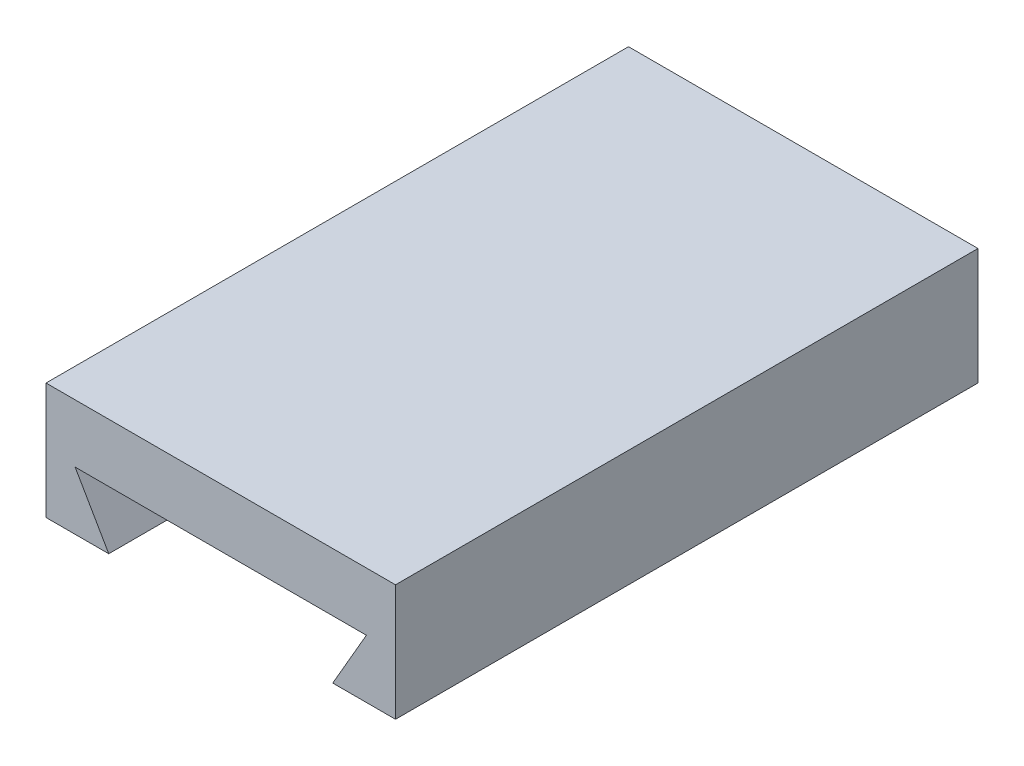
ISO-10303-21;
HEADER;
FILE_DESCRIPTION(('STEP AP214'),'2;1');
FILE_NAME('part.step','',(''),(''),'','','');
FILE_SCHEMA(('AUTOMOTIVE_DESIGN { 1 0 10303 214 1 1 1 1 }'));
ENDSEC;
DATA;
#1=APPLICATION_CONTEXT('core data for automotive mechanical design processes');
#2=APPLICATION_PROTOCOL_DEFINITION('international standard','automotive_design',2000,#1);
#3=PRODUCT_CONTEXT('',#1,'mechanical');
#4=PRODUCT('Part','Part','',(#3));
#5=PRODUCT_RELATED_PRODUCT_CATEGORY('part','',(#4));
#6=PRODUCT_DEFINITION_FORMATION('','',#4);
#7=PRODUCT_DEFINITION_CONTEXT('part definition',#1,'design');
#8=PRODUCT_DEFINITION('design','',#6,#7);
#9=PRODUCT_DEFINITION_SHAPE('','',#8);
#10=(LENGTH_UNIT() NAMED_UNIT(*) SI_UNIT(.MILLI.,.METRE.));
#11=(NAMED_UNIT(*) PLANE_ANGLE_UNIT() SI_UNIT($,.RADIAN.));
#12=(NAMED_UNIT(*) SI_UNIT($,.STERADIAN.) SOLID_ANGLE_UNIT());
#13=UNCERTAINTY_MEASURE_WITH_UNIT(LENGTH_MEASURE(1.E-05),#10,'distance_accuracy_value','');
#14=(GEOMETRIC_REPRESENTATION_CONTEXT(3) GLOBAL_UNCERTAINTY_ASSIGNED_CONTEXT((#13)) GLOBAL_UNIT_ASSIGNED_CONTEXT((#10,
#11,#12)) REPRESENTATION_CONTEXT('',''));
#15=CARTESIAN_POINT('',(0.,0.,0.));
#16=DIRECTION('',(0.,0.,1.));
#17=DIRECTION('',(1.,0.,0.));
#18=AXIS2_PLACEMENT_3D('',#15,#16,#17);
#19=CARTESIAN_POINT('',(0.,0.500000000000001,5.));
#20=DIRECTION('',(0.,1.,0.));
#21=DIRECTION('',(-1.,0.,0.));
#22=AXIS2_PLACEMENT_3D('',#19,#20,#21);
#23=PLANE('',#22);
#24=DIRECTION('',(1.,0.,0.));
#25=VECTOR('',#24,1.);
#26=CARTESIAN_POINT('',(0.,0.500000000000001,0.));
#27=LINE('',#26,#25);
#28=CARTESIAN_POINT('',(-1.25,0.500000000000001,0.));
#29=VERTEX_POINT('',#28);
#30=CARTESIAN_POINT('',(1.25,0.5,0.));
#31=VERTEX_POINT('',#30);
#32=EDGE_CURVE('E168',#29,#31,#27,.T.);
#33=ORIENTED_EDGE('',*,*,#32,.T.);
#34=DIRECTION('',(0.,0.,-1.));
#35=VECTOR('',#34,1.);
#36=CARTESIAN_POINT('',(1.25,0.5,5.));
#37=LINE('',#36,#35);
#38=CARTESIAN_POINT('',(1.25,0.5,5.));
#39=VERTEX_POINT('',#38);
#40=EDGE_CURVE('E11',#39,#31,#37,.T.);
#41=ORIENTED_EDGE('',*,*,#40,.F.);
#42=DIRECTION('',(1.,0.,0.));
#43=VECTOR('',#42,1.);
#44=CARTESIAN_POINT('',(0.,0.500000000000001,5.));
#45=LINE('',#44,#43);
#46=CARTESIAN_POINT('',(-1.25,0.500000000000001,5.));
#47=VERTEX_POINT('',#46);
#48=EDGE_CURVE('E89',#47,#39,#45,.T.);
#49=ORIENTED_EDGE('',*,*,#48,.F.);
#50=DIRECTION('',(0.,0.,-1.));
#51=VECTOR('',#50,1.);
#52=CARTESIAN_POINT('',(-1.25,0.500000000000001,5.));
#53=LINE('',#52,#51);
#54=EDGE_CURVE('E51',#47,#29,#53,.T.);
#55=ORIENTED_EDGE('',*,*,#54,.T.);
#56=EDGE_LOOP('',(#33,#41,#49,#55));
#57=FACE_BOUND('',#56,.T.);
#58=ADVANCED_FACE('F35',(#57),#23,.F.);
#59=CARTESIAN_POINT('',(0.72099364905389,-0.416265877365274,5.));
#60=DIRECTION('',(-0.866025403784439,0.5,0.));
#61=DIRECTION('',(-0.5,-0.866025403784439,0.));
#62=AXIS2_PLACEMENT_3D('',#59,#60,#61);
#63=PLANE('',#62);
#64=DIRECTION('',(0.5,0.866025403784439,0.));
#65=VECTOR('',#64,1.);
#66=CARTESIAN_POINT('',(0.72099364905389,-0.416265877365274,0.));
#67=LINE('',#66,#65);
#68=CARTESIAN_POINT('',(0.961324865405187,0.,0.));
#69=VERTEX_POINT('',#68);
#70=EDGE_CURVE('E163',#69,#31,#67,.T.);
#71=ORIENTED_EDGE('',*,*,#70,.F.);
#72=DIRECTION('',(0.,0.,-1.));
#73=VECTOR('',#72,1.);
#74=CARTESIAN_POINT('',(0.961324865405187,0.,5.));
#75=LINE('',#74,#73);
#76=CARTESIAN_POINT('',(0.961324865405187,0.,5.));
#77=VERTEX_POINT('',#76);
#78=EDGE_CURVE('E43',#77,#69,#75,.T.);
#79=ORIENTED_EDGE('',*,*,#78,.F.);
#80=DIRECTION('',(0.5,0.866025403784439,0.));
#81=VECTOR('',#80,1.);
#82=CARTESIAN_POINT('',(0.72099364905389,-0.416265877365274,5.));
#83=LINE('',#82,#81);
#84=EDGE_CURVE('E132',#77,#39,#83,.T.);
#85=ORIENTED_EDGE('',*,*,#84,.T.);
#86=ORIENTED_EDGE('',*,*,#40,.T.);
#87=EDGE_LOOP('',(#71,#79,#85,#86));
#88=FACE_BOUND('',#87,.T.);
#89=ADVANCED_FACE('F167',(#88),#63,.T.);
#90=CARTESIAN_POINT('',(0.,0.,5.));
#91=DIRECTION('',(0.,1.,0.));
#92=DIRECTION('',(0.,0.,1.));
#93=AXIS2_PLACEMENT_3D('',#90,#91,#92);
#94=PLANE('',#93);
#95=DIRECTION('',(1.,0.,0.));
#96=VECTOR('',#95,1.);
#97=CARTESIAN_POINT('',(0.,0.,0.));
#98=LINE('',#97,#96);
#99=CARTESIAN_POINT('',(1.5,0.,0.));
#100=VERTEX_POINT('',#99);
#101=EDGE_CURVE('E145',#69,#100,#98,.T.);
#102=ORIENTED_EDGE('',*,*,#101,.T.);
#103=DIRECTION('',(0.,0.,-1.));
#104=VECTOR('',#103,1.);
#105=CARTESIAN_POINT('',(1.5,0.,5.));
#106=LINE('',#105,#104);
#107=CARTESIAN_POINT('',(1.5,0.,5.));
#108=VERTEX_POINT('',#107);
#109=EDGE_CURVE('E154',#108,#100,#106,.T.);
#110=ORIENTED_EDGE('',*,*,#109,.F.);
#111=DIRECTION('',(1.,0.,0.));
#112=VECTOR('',#111,1.);
#113=CARTESIAN_POINT('',(0.,0.,5.));
#114=LINE('',#113,#112);
#115=EDGE_CURVE('E127',#77,#108,#114,.T.);
#116=ORIENTED_EDGE('',*,*,#115,.F.);
#117=ORIENTED_EDGE('',*,*,#78,.T.);
#118=EDGE_LOOP('',(#102,#110,#116,#117));
#119=FACE_BOUND('',#118,.T.);
#120=ADVANCED_FACE('F158',(#119),#94,.F.);
#121=CARTESIAN_POINT('',(1.5,0.,5.));
#122=DIRECTION('',(1.,0.,0.));
#123=DIRECTION('',(0.,1.,0.));
#124=AXIS2_PLACEMENT_3D('',#121,#122,#123);
#125=PLANE('',#124);
#126=DIRECTION('',(0.,-1.,0.));
#127=VECTOR('',#126,1.);
#128=CARTESIAN_POINT('',(1.5,0.,0.));
#129=LINE('',#128,#127);
#130=CARTESIAN_POINT('',(1.5,1.,0.));
#131=VERTEX_POINT('',#130);
#132=EDGE_CURVE('E166',#131,#100,#129,.T.);
#133=ORIENTED_EDGE('',*,*,#132,.F.);
#134=DIRECTION('',(0.,0.,-1.));
#135=VECTOR('',#134,1.);
#136=CARTESIAN_POINT('',(1.5,1.,5.));
#137=LINE('',#136,#135);
#138=CARTESIAN_POINT('',(1.5,1.,5.));
#139=VERTEX_POINT('',#138);
#140=EDGE_CURVE('E152',#139,#131,#137,.T.);
#141=ORIENTED_EDGE('',*,*,#140,.F.);
#142=DIRECTION('',(0.,-1.,0.));
#143=VECTOR('',#142,1.);
#144=CARTESIAN_POINT('',(1.5,0.,5.));
#145=LINE('',#144,#143);
#146=EDGE_CURVE('E131',#139,#108,#145,.T.);
#147=ORIENTED_EDGE('',*,*,#146,.T.);
#148=ORIENTED_EDGE('',*,*,#109,.T.);
#149=EDGE_LOOP('',(#133,#141,#147,#148));
#150=FACE_BOUND('',#149,.T.);
#151=ADVANCED_FACE('F177',(#150),#125,.T.);
#152=CARTESIAN_POINT('',(0.,1.,5.));
#153=DIRECTION('',(0.,1.,0.));
#154=DIRECTION('',(0.,0.,1.));
#155=AXIS2_PLACEMENT_3D('',#152,#153,#154);
#156=PLANE('',#155);
#157=DIRECTION('',(1.,0.,0.));
#158=VECTOR('',#157,1.);
#159=CARTESIAN_POINT('',(0.,1.,0.));
#160=LINE('',#159,#158);
#161=CARTESIAN_POINT('',(-1.5,1.,0.));
#162=VERTEX_POINT('',#161);
#163=EDGE_CURVE('E172',#162,#131,#160,.T.);
#164=ORIENTED_EDGE('',*,*,#163,.F.);
#165=DIRECTION('',(0.,0.,-1.));
#166=VECTOR('',#165,1.);
#167=CARTESIAN_POINT('',(-1.5,1.,5.));
#168=LINE('',#167,#166);
#169=CARTESIAN_POINT('',(-1.5,1.,5.));
#170=VERTEX_POINT('',#169);
#171=EDGE_CURVE('E122',#170,#162,#168,.T.);
#172=ORIENTED_EDGE('',*,*,#171,.F.);
#173=DIRECTION('',(1.,0.,0.));
#174=VECTOR('',#173,1.);
#175=CARTESIAN_POINT('',(0.,1.,5.));
#176=LINE('',#175,#174);
#177=EDGE_CURVE('E112',#170,#139,#176,.T.);
#178=ORIENTED_EDGE('',*,*,#177,.T.);
#179=ORIENTED_EDGE('',*,*,#140,.T.);
#180=EDGE_LOOP('',(#164,#172,#178,#179));
#181=FACE_BOUND('',#180,.T.);
#182=ADVANCED_FACE('F175',(#181),#156,.T.);
#183=CARTESIAN_POINT('',(-1.5,0.,5.));
#184=DIRECTION('',(1.,0.,0.));
#185=DIRECTION('',(0.,1.,0.));
#186=AXIS2_PLACEMENT_3D('',#183,#184,#185);
#187=PLANE('',#186);
#188=DIRECTION('',(0.,-1.,0.));
#189=VECTOR('',#188,1.);
#190=CARTESIAN_POINT('',(-1.5,0.,0.));
#191=LINE('',#190,#189);
#192=CARTESIAN_POINT('',(-1.5,0.,0.));
#193=VERTEX_POINT('',#192);
#194=EDGE_CURVE('E119',#162,#193,#191,.T.);
#195=ORIENTED_EDGE('',*,*,#194,.T.);
#196=DIRECTION('',(0.,0.,-1.));
#197=VECTOR('',#196,1.);
#198=CARTESIAN_POINT('',(-1.5,0.,5.));
#199=LINE('',#198,#197);
#200=CARTESIAN_POINT('',(-1.5,0.,5.));
#201=VERTEX_POINT('',#200);
#202=EDGE_CURVE('E116',#201,#193,#199,.T.);
#203=ORIENTED_EDGE('',*,*,#202,.F.);
#204=DIRECTION('',(0.,-1.,0.));
#205=VECTOR('',#204,1.);
#206=CARTESIAN_POINT('',(-1.5,0.,5.));
#207=LINE('',#206,#205);
#208=EDGE_CURVE('E105',#170,#201,#207,.T.);
#209=ORIENTED_EDGE('',*,*,#208,.F.);
#210=ORIENTED_EDGE('',*,*,#171,.T.);
#211=EDGE_LOOP('',(#195,#203,#209,#210));
#212=FACE_BOUND('',#211,.T.);
#213=ADVANCED_FACE('F117',(#212),#187,.F.);
#214=CARTESIAN_POINT('',(-0.961324865405186,0.,0.));
#215=VERTEX_POINT('',#214);
#216=EDGE_CURVE('E141',#193,#215,#98,.T.);
#217=ORIENTED_EDGE('',*,*,#216,.T.);
#218=DIRECTION('',(0.,0.,-1.));
#219=VECTOR('',#218,1.);
#220=CARTESIAN_POINT('',(-0.961324865405186,0.,5.));
#221=LINE('',#220,#219);
#222=CARTESIAN_POINT('',(-0.961324865405186,0.,5.));
#223=VERTEX_POINT('',#222);
#224=EDGE_CURVE('E77',#223,#215,#221,.T.);
#225=ORIENTED_EDGE('',*,*,#224,.F.);
#226=EDGE_CURVE('E109',#201,#223,#114,.T.);
#227=ORIENTED_EDGE('',*,*,#226,.F.);
#228=ORIENTED_EDGE('',*,*,#202,.T.);
#229=EDGE_LOOP('',(#217,#225,#227,#228));
#230=FACE_BOUND('',#229,.T.);
#231=ADVANCED_FACE('F124',(#230),#94,.F.);
#232=CARTESIAN_POINT('',(-0.72099364905389,-0.416265877365273,5.));
#233=DIRECTION('',(0.866025403784439,0.5,0.));
#234=DIRECTION('',(-0.5,0.866025403784439,0.));
#235=AXIS2_PLACEMENT_3D('',#232,#233,#234);
#236=PLANE('',#235);
#237=DIRECTION('',(0.5,-0.866025403784439,0.));
#238=VECTOR('',#237,1.);
#239=CARTESIAN_POINT('',(-0.72099364905389,-0.416265877365273,0.));
#240=LINE('',#239,#238);
#241=EDGE_CURVE('E138',#29,#215,#240,.T.);
#242=ORIENTED_EDGE('',*,*,#241,.F.);
#243=ORIENTED_EDGE('',*,*,#54,.F.);
#244=DIRECTION('',(0.5,-0.866025403784439,0.));
#245=VECTOR('',#244,1.);
#246=CARTESIAN_POINT('',(-0.72099364905389,-0.416265877365273,5.));
#247=LINE('',#246,#245);
#248=EDGE_CURVE('E125',#47,#223,#247,.T.);
#249=ORIENTED_EDGE('',*,*,#248,.T.);
#250=ORIENTED_EDGE('',*,*,#224,.T.);
#251=EDGE_LOOP('',(#242,#243,#249,#250));
#252=FACE_BOUND('',#251,.T.);
#253=ADVANCED_FACE('F190',(#252),#236,.T.);
#254=CARTESIAN_POINT('',(0.,0.,5.));
#255=DIRECTION('',(0.,0.,1.));
#256=DIRECTION('',(1.,0.,0.));
#257=AXIS2_PLACEMENT_3D('',#254,#255,#256);
#258=PLANE('',#257);
#259=ORIENTED_EDGE('',*,*,#48,.T.);
#260=ORIENTED_EDGE('',*,*,#84,.F.);
#261=ORIENTED_EDGE('',*,*,#115,.T.);
#262=ORIENTED_EDGE('',*,*,#146,.F.);
#263=ORIENTED_EDGE('',*,*,#177,.F.);
#264=ORIENTED_EDGE('',*,*,#208,.T.);
#265=ORIENTED_EDGE('',*,*,#226,.T.);
#266=ORIENTED_EDGE('',*,*,#248,.F.);
#267=EDGE_LOOP('',(#259,#260,#261,#262,#263,#264,#265,#266));
#268=FACE_BOUND('',#267,.T.);
#269=ADVANCED_FACE('F107',(#268),#258,.T.);
#270=CARTESIAN_POINT('',(0.,0.,0.));
#271=DIRECTION('',(0.,0.,1.));
#272=DIRECTION('',(1.,0.,0.));
#273=AXIS2_PLACEMENT_3D('',#270,#271,#272);
#274=PLANE('',#273);
#275=ORIENTED_EDGE('',*,*,#32,.F.);
#276=ORIENTED_EDGE('',*,*,#241,.T.);
#277=ORIENTED_EDGE('',*,*,#216,.F.);
#278=ORIENTED_EDGE('',*,*,#194,.F.);
#279=ORIENTED_EDGE('',*,*,#163,.T.);
#280=ORIENTED_EDGE('',*,*,#132,.T.);
#281=ORIENTED_EDGE('',*,*,#101,.F.);
#282=ORIENTED_EDGE('',*,*,#70,.T.);
#283=EDGE_LOOP('',(#275,#276,#277,#278,#279,#280,#281,#282));
#284=FACE_BOUND('',#283,.T.);
#285=ADVANCED_FACE('F162',(#284),#274,.F.);
#286=CLOSED_SHELL('',(#58,#89,#120,#151,#182,#213,#231,#253,#269,#285));
#287=MANIFOLD_SOLID_BREP('B2',#286);
#288=ADVANCED_BREP_SHAPE_REPRESENTATION('',(#18,#287),#14);
#289=SHAPE_DEFINITION_REPRESENTATION(#9,#288);
ENDSEC;
END-ISO-10303-21;
